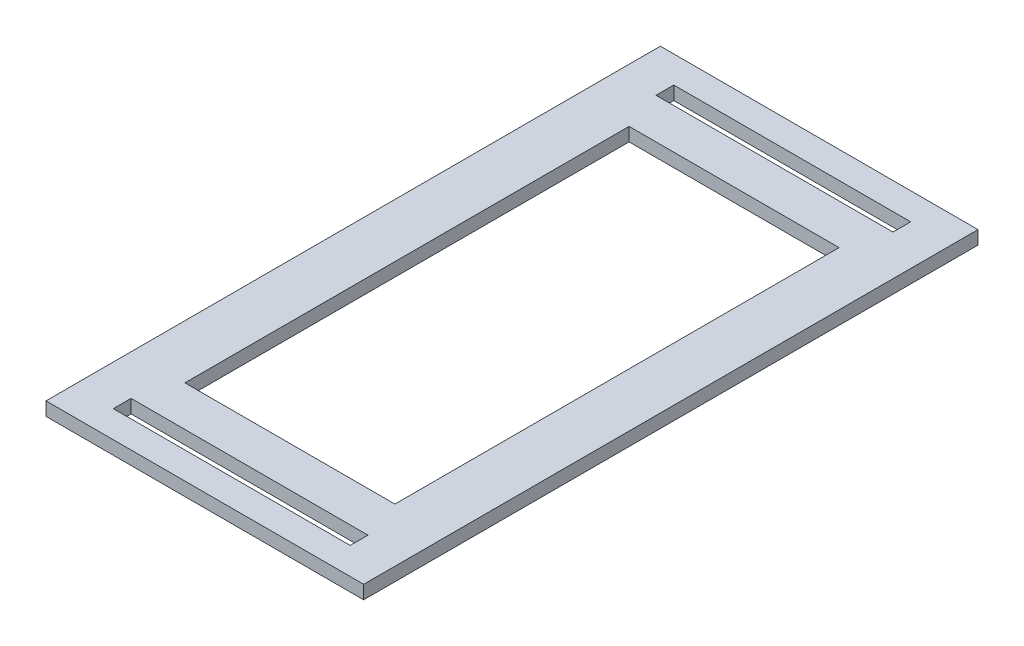
ISO-10303-21;
HEADER;
FILE_DESCRIPTION(('STEP AP214'),'2;1');
FILE_NAME('part.step','',(''),(''),'','','');
FILE_SCHEMA(('AUTOMOTIVE_DESIGN { 1 0 10303 214 1 1 1 1 }'));
ENDSEC;
DATA;
#1=APPLICATION_CONTEXT('core data for automotive mechanical design processes');
#2=APPLICATION_PROTOCOL_DEFINITION('international standard','automotive_design',2000,#1);
#3=PRODUCT_CONTEXT('',#1,'mechanical');
#4=PRODUCT('Part','Part','',(#3));
#5=PRODUCT_RELATED_PRODUCT_CATEGORY('part','',(#4));
#6=PRODUCT_DEFINITION_FORMATION('','',#4);
#7=PRODUCT_DEFINITION_CONTEXT('part definition',#1,'design');
#8=PRODUCT_DEFINITION('design','',#6,#7);
#9=PRODUCT_DEFINITION_SHAPE('','',#8);
#10=(LENGTH_UNIT() NAMED_UNIT(*) SI_UNIT(.MILLI.,.METRE.));
#11=(NAMED_UNIT(*) PLANE_ANGLE_UNIT() SI_UNIT($,.RADIAN.));
#12=(NAMED_UNIT(*) SI_UNIT($,.STERADIAN.) SOLID_ANGLE_UNIT());
#13=UNCERTAINTY_MEASURE_WITH_UNIT(LENGTH_MEASURE(1.E-05),#10,'distance_accuracy_value','');
#14=(GEOMETRIC_REPRESENTATION_CONTEXT(3) GLOBAL_UNCERTAINTY_ASSIGNED_CONTEXT((#13)) GLOBAL_UNIT_ASSIGNED_CONTEXT((#10,
#11,#12)) REPRESENTATION_CONTEXT('',''));
#15=CARTESIAN_POINT('',(0.,0.,0.));
#16=DIRECTION('',(0.,0.,1.));
#17=DIRECTION('',(1.,0.,0.));
#18=AXIS2_PLACEMENT_3D('',#15,#16,#17);
#19=CARTESIAN_POINT('',(0.,3.175,0.));
#20=DIRECTION('',(0.,1.,0.));
#21=DIRECTION('',(0.,0.,1.));
#22=AXIS2_PLACEMENT_3D('',#19,#20,#21);
#23=PLANE('',#22);
#24=DIRECTION('',(0.,0.,1.));
#25=VECTOR('',#24,1.);
#26=CARTESIAN_POINT('',(-37.465,3.175,-72.4535));
#27=LINE('',#26,#25);
#28=CARTESIAN_POINT('',(-37.465,3.175,-72.4535));
#29=VERTEX_POINT('',#28);
#30=CARTESIAN_POINT('',(-37.465,3.175,72.4535));
#31=VERTEX_POINT('',#30);
#32=EDGE_CURVE('E246',#29,#31,#27,.T.);
#33=ORIENTED_EDGE('',*,*,#32,.T.);
#34=DIRECTION('',(1.,0.,0.));
#35=VECTOR('',#34,1.);
#36=CARTESIAN_POINT('',(-37.465,3.175,72.4535));
#37=LINE('',#36,#35);
#38=CARTESIAN_POINT('',(37.465,3.175,72.4535));
#39=VERTEX_POINT('',#38);
#40=EDGE_CURVE('E249',#31,#39,#37,.T.);
#41=ORIENTED_EDGE('',*,*,#40,.T.);
#42=DIRECTION('',(0.,0.,-1.));
#43=VECTOR('',#42,1.);
#44=CARTESIAN_POINT('',(37.465,3.175,-72.4535));
#45=LINE('',#44,#43);
#46=CARTESIAN_POINT('',(37.465,3.175,-72.4535));
#47=VERTEX_POINT('',#46);
#48=EDGE_CURVE('E252',#39,#47,#45,.T.);
#49=ORIENTED_EDGE('',*,*,#48,.T.);
#50=DIRECTION('',(-1.,0.,0.));
#51=VECTOR('',#50,1.);
#52=CARTESIAN_POINT('',(-37.465,3.175,-72.4535));
#53=LINE('',#52,#51);
#54=EDGE_CURVE('E254',#47,#29,#53,.T.);
#55=ORIENTED_EDGE('',*,*,#54,.T.);
#56=EDGE_LOOP('',(#33,#41,#49,#55));
#57=FACE_BOUND('',#56,.T.);
#58=DIRECTION('',(1.,0.,0.));
#59=VECTOR('',#58,1.);
#60=CARTESIAN_POINT('',(-27.94,3.175,66.1035));
#61=LINE('',#60,#59);
#62=CARTESIAN_POINT('',(-27.94,3.175,66.1035));
#63=VERTEX_POINT('',#62);
#64=CARTESIAN_POINT('',(27.94,3.175,66.1035));
#65=VERTEX_POINT('',#64);
#66=EDGE_CURVE('E217',#63,#65,#61,.T.);
#67=ORIENTED_EDGE('',*,*,#66,.F.);
#68=DIRECTION('',(0.,0.,1.));
#69=VECTOR('',#68,1.);
#70=CARTESIAN_POINT('',(-27.94,3.175,61.9125));
#71=LINE('',#70,#69);
#72=CARTESIAN_POINT('',(-27.94,3.175,61.9125));
#73=VERTEX_POINT('',#72);
#74=EDGE_CURVE('E215',#73,#63,#71,.T.);
#75=ORIENTED_EDGE('',*,*,#74,.F.);
#76=DIRECTION('',(-1.,0.,0.));
#77=VECTOR('',#76,1.);
#78=CARTESIAN_POINT('',(-27.94,3.175,61.9125));
#79=LINE('',#78,#77);
#80=CARTESIAN_POINT('',(27.94,3.175,61.9125));
#81=VERTEX_POINT('',#80);
#82=EDGE_CURVE('E223',#81,#73,#79,.T.);
#83=ORIENTED_EDGE('',*,*,#82,.F.);
#84=DIRECTION('',(0.,0.,-1.));
#85=VECTOR('',#84,1.);
#86=CARTESIAN_POINT('',(27.94,3.175,61.9125));
#87=LINE('',#86,#85);
#88=EDGE_CURVE('E220',#65,#81,#87,.T.);
#89=ORIENTED_EDGE('',*,*,#88,.F.);
#90=EDGE_LOOP('',(#67,#75,#83,#89));
#91=FACE_BOUND('',#90,.T.);
#92=DIRECTION('',(1.,0.,0.));
#93=VECTOR('',#92,1.);
#94=CARTESIAN_POINT('',(-27.94,3.175,-61.9125));
#95=LINE('',#94,#93);
#96=CARTESIAN_POINT('',(-27.94,3.175,-61.9125));
#97=VERTEX_POINT('',#96);
#98=CARTESIAN_POINT('',(27.94,3.175,-61.9125));
#99=VERTEX_POINT('',#98);
#100=EDGE_CURVE('E186',#97,#99,#95,.T.);
#101=ORIENTED_EDGE('',*,*,#100,.F.);
#102=DIRECTION('',(0.,0.,1.));
#103=VECTOR('',#102,1.);
#104=CARTESIAN_POINT('',(-27.94,3.175,-66.1035));
#105=LINE('',#104,#103);
#106=CARTESIAN_POINT('',(-27.94,3.175,-66.1035));
#107=VERTEX_POINT('',#106);
#108=EDGE_CURVE('E184',#107,#97,#105,.T.);
#109=ORIENTED_EDGE('',*,*,#108,.F.);
#110=DIRECTION('',(-1.,0.,0.));
#111=VECTOR('',#110,1.);
#112=CARTESIAN_POINT('',(-27.94,3.175,-66.1035));
#113=LINE('',#112,#111);
#114=CARTESIAN_POINT('',(27.94,3.175,-66.1035));
#115=VERTEX_POINT('',#114);
#116=EDGE_CURVE('E192',#115,#107,#113,.T.);
#117=ORIENTED_EDGE('',*,*,#116,.F.);
#118=DIRECTION('',(0.,0.,-1.));
#119=VECTOR('',#118,1.);
#120=CARTESIAN_POINT('',(27.94,3.175,-66.1035));
#121=LINE('',#120,#119);
#122=EDGE_CURVE('E189',#99,#115,#121,.T.);
#123=ORIENTED_EDGE('',*,*,#122,.F.);
#124=EDGE_LOOP('',(#101,#109,#117,#123));
#125=FACE_BOUND('',#124,.T.);
#126=DIRECTION('',(1.,0.,0.));
#127=VECTOR('',#126,1.);
#128=CARTESIAN_POINT('',(-24.765,3.175,52.3875));
#129=LINE('',#128,#127);
#130=CARTESIAN_POINT('',(-24.765,3.175,52.3875));
#131=VERTEX_POINT('',#130);
#132=CARTESIAN_POINT('',(24.765,3.175,52.3875));
#133=VERTEX_POINT('',#132);
#134=EDGE_CURVE('E156',#131,#133,#129,.T.);
#135=ORIENTED_EDGE('',*,*,#134,.F.);
#136=DIRECTION('',(0.,0.,1.));
#137=VECTOR('',#136,1.);
#138=CARTESIAN_POINT('',(-24.765,3.175,-52.3875));
#139=LINE('',#138,#137);
#140=CARTESIAN_POINT('',(-24.765,3.175,-52.3875));
#141=VERTEX_POINT('',#140);
#142=EDGE_CURVE('E148',#141,#131,#139,.T.);
#143=ORIENTED_EDGE('',*,*,#142,.F.);
#144=DIRECTION('',(-1.,0.,0.));
#145=VECTOR('',#144,1.);
#146=CARTESIAN_POINT('',(-24.765,3.175,-52.3875));
#147=LINE('',#146,#145);
#148=CARTESIAN_POINT('',(24.765,3.175,-52.3875));
#149=VERTEX_POINT('',#148);
#150=EDGE_CURVE('E170',#149,#141,#147,.T.);
#151=ORIENTED_EDGE('',*,*,#150,.F.);
#152=DIRECTION('',(0.,0.,-1.));
#153=VECTOR('',#152,1.);
#154=CARTESIAN_POINT('',(24.765,3.175,-52.3875));
#155=LINE('',#154,#153);
#156=EDGE_CURVE('E168',#133,#149,#155,.T.);
#157=ORIENTED_EDGE('',*,*,#156,.F.);
#158=EDGE_LOOP('',(#135,#143,#151,#157));
#159=FACE_BOUND('',#158,.T.);
#160=ADVANCED_FACE('F35',(#57,#91,#125,#159),#23,.T.);
#161=CARTESIAN_POINT('',(0.,0.,0.));
#162=DIRECTION('',(0.,1.,0.));
#163=DIRECTION('',(0.,0.,1.));
#164=AXIS2_PLACEMENT_3D('',#161,#162,#163);
#165=PLANE('',#164);
#166=DIRECTION('',(0.,0.,1.));
#167=VECTOR('',#166,1.);
#168=CARTESIAN_POINT('',(-27.94,0.,-66.1035));
#169=LINE('',#168,#167);
#170=CARTESIAN_POINT('',(-27.94,0.,-66.1035));
#171=VERTEX_POINT('',#170);
#172=CARTESIAN_POINT('',(-27.94,0.,-61.9125));
#173=VERTEX_POINT('',#172);
#174=EDGE_CURVE('E164',#171,#173,#169,.T.);
#175=ORIENTED_EDGE('',*,*,#174,.T.);
#176=DIRECTION('',(1.,0.,0.));
#177=VECTOR('',#176,1.);
#178=CARTESIAN_POINT('',(-27.94,0.,-61.9125));
#179=LINE('',#178,#177);
#180=CARTESIAN_POINT('',(27.94,0.,-61.9125));
#181=VERTEX_POINT('',#180);
#182=EDGE_CURVE('E197',#173,#181,#179,.T.);
#183=ORIENTED_EDGE('',*,*,#182,.T.);
#184=DIRECTION('',(0.,0.,-1.));
#185=VECTOR('',#184,1.);
#186=CARTESIAN_POINT('',(27.94,0.,-66.1035));
#187=LINE('',#186,#185);
#188=CARTESIAN_POINT('',(27.94,0.,-66.1035));
#189=VERTEX_POINT('',#188);
#190=EDGE_CURVE('E200',#181,#189,#187,.T.);
#191=ORIENTED_EDGE('',*,*,#190,.T.);
#192=DIRECTION('',(-1.,0.,0.));
#193=VECTOR('',#192,1.);
#194=CARTESIAN_POINT('',(-27.94,0.,-66.1035));
#195=LINE('',#194,#193);
#196=EDGE_CURVE('E187',#189,#171,#195,.T.);
#197=ORIENTED_EDGE('',*,*,#196,.T.);
#198=EDGE_LOOP('',(#175,#183,#191,#197));
#199=FACE_BOUND('',#198,.T.);
#200=DIRECTION('',(0.,0.,1.));
#201=VECTOR('',#200,1.);
#202=CARTESIAN_POINT('',(-37.465,0.,-72.4535));
#203=LINE('',#202,#201);
#204=CARTESIAN_POINT('',(-37.465,0.,-72.4535));
#205=VERTEX_POINT('',#204);
#206=CARTESIAN_POINT('',(-37.465,0.,72.4535));
#207=VERTEX_POINT('',#206);
#208=EDGE_CURVE('E245',#205,#207,#203,.T.);
#209=ORIENTED_EDGE('',*,*,#208,.F.);
#210=DIRECTION('',(-1.,0.,0.));
#211=VECTOR('',#210,1.);
#212=CARTESIAN_POINT('',(-37.465,0.,-72.4535));
#213=LINE('',#212,#211);
#214=CARTESIAN_POINT('',(37.465,0.,-72.4535));
#215=VERTEX_POINT('',#214);
#216=EDGE_CURVE('E250',#215,#205,#213,.T.);
#217=ORIENTED_EDGE('',*,*,#216,.F.);
#218=DIRECTION('',(0.,0.,-1.));
#219=VECTOR('',#218,1.);
#220=CARTESIAN_POINT('',(37.465,0.,-72.4535));
#221=LINE('',#220,#219);
#222=CARTESIAN_POINT('',(37.465,0.,72.4535));
#223=VERTEX_POINT('',#222);
#224=EDGE_CURVE('E261',#223,#215,#221,.T.);
#225=ORIENTED_EDGE('',*,*,#224,.F.);
#226=DIRECTION('',(1.,0.,0.));
#227=VECTOR('',#226,1.);
#228=CARTESIAN_POINT('',(-37.465,0.,72.4535));
#229=LINE('',#228,#227);
#230=EDGE_CURVE('E259',#207,#223,#229,.T.);
#231=ORIENTED_EDGE('',*,*,#230,.F.);
#232=EDGE_LOOP('',(#209,#217,#225,#231));
#233=FACE_BOUND('',#232,.T.);
#234=DIRECTION('',(0.,0.,1.));
#235=VECTOR('',#234,1.);
#236=CARTESIAN_POINT('',(-27.94,0.,61.9125));
#237=LINE('',#236,#235);
#238=CARTESIAN_POINT('',(-27.94,0.,61.9125));
#239=VERTEX_POINT('',#238);
#240=CARTESIAN_POINT('',(-27.94,0.,66.1035));
#241=VERTEX_POINT('',#240);
#242=EDGE_CURVE('E214',#239,#241,#237,.T.);
#243=ORIENTED_EDGE('',*,*,#242,.T.);
#244=DIRECTION('',(1.,0.,0.));
#245=VECTOR('',#244,1.);
#246=CARTESIAN_POINT('',(-27.94,0.,66.1035));
#247=LINE('',#246,#245);
#248=CARTESIAN_POINT('',(27.94,0.,66.1035));
#249=VERTEX_POINT('',#248);
#250=EDGE_CURVE('E228',#241,#249,#247,.T.);
#251=ORIENTED_EDGE('',*,*,#250,.T.);
#252=DIRECTION('',(0.,0.,-1.));
#253=VECTOR('',#252,1.);
#254=CARTESIAN_POINT('',(27.94,0.,61.9125));
#255=LINE('',#254,#253);
#256=CARTESIAN_POINT('',(27.94,0.,61.9125));
#257=VERTEX_POINT('',#256);
#258=EDGE_CURVE('E231',#249,#257,#255,.T.);
#259=ORIENTED_EDGE('',*,*,#258,.T.);
#260=DIRECTION('',(-1.,0.,0.));
#261=VECTOR('',#260,1.);
#262=CARTESIAN_POINT('',(-27.94,0.,61.9125));
#263=LINE('',#262,#261);
#264=EDGE_CURVE('E218',#257,#239,#263,.T.);
#265=ORIENTED_EDGE('',*,*,#264,.T.);
#266=EDGE_LOOP('',(#243,#251,#259,#265));
#267=FACE_BOUND('',#266,.T.);
#268=DIRECTION('',(0.,0.,1.));
#269=VECTOR('',#268,1.);
#270=CARTESIAN_POINT('',(-24.765,0.,-52.3875));
#271=LINE('',#270,#269);
#272=CARTESIAN_POINT('',(-24.765,0.,-52.3875));
#273=VERTEX_POINT('',#272);
#274=CARTESIAN_POINT('',(-24.765,0.,52.3875));
#275=VERTEX_POINT('',#274);
#276=EDGE_CURVE('E58',#273,#275,#271,.T.);
#277=ORIENTED_EDGE('',*,*,#276,.T.);
#278=DIRECTION('',(1.,0.,0.));
#279=VECTOR('',#278,1.);
#280=CARTESIAN_POINT('',(-24.765,0.,52.3875));
#281=LINE('',#280,#279);
#282=CARTESIAN_POINT('',(24.765,0.,52.3875));
#283=VERTEX_POINT('',#282);
#284=EDGE_CURVE('E163',#275,#283,#281,.T.);
#285=ORIENTED_EDGE('',*,*,#284,.T.);
#286=DIRECTION('',(0.,0.,-1.));
#287=VECTOR('',#286,1.);
#288=CARTESIAN_POINT('',(24.765,0.,-52.3875));
#289=LINE('',#288,#287);
#290=CARTESIAN_POINT('',(24.765,0.,-52.3875));
#291=VERTEX_POINT('',#290);
#292=EDGE_CURVE('E176',#283,#291,#289,.T.);
#293=ORIENTED_EDGE('',*,*,#292,.T.);
#294=DIRECTION('',(-1.,0.,0.));
#295=VECTOR('',#294,1.);
#296=CARTESIAN_POINT('',(-24.765,0.,-52.3875));
#297=LINE('',#296,#295);
#298=EDGE_CURVE('E157',#291,#273,#297,.T.);
#299=ORIENTED_EDGE('',*,*,#298,.T.);
#300=EDGE_LOOP('',(#277,#285,#293,#299));
#301=FACE_BOUND('',#300,.T.);
#302=ADVANCED_FACE('F279',(#199,#233,#267,#301),#165,.F.);
#303=CARTESIAN_POINT('',(-37.465,3.175,-72.4535));
#304=DIRECTION('',(1.,0.,0.));
#305=DIRECTION('',(0.,0.,-1.));
#306=AXIS2_PLACEMENT_3D('',#303,#304,#305);
#307=PLANE('',#306);
#308=ORIENTED_EDGE('',*,*,#208,.T.);
#309=DIRECTION('',(0.,-1.,0.));
#310=VECTOR('',#309,1.);
#311=CARTESIAN_POINT('',(-37.465,3.175,72.4535));
#312=LINE('',#311,#310);
#313=EDGE_CURVE('E11',#31,#207,#312,.T.);
#314=ORIENTED_EDGE('',*,*,#313,.F.);
#315=ORIENTED_EDGE('',*,*,#32,.F.);
#316=DIRECTION('',(0.,-1.,0.));
#317=VECTOR('',#316,1.);
#318=CARTESIAN_POINT('',(-37.465,3.175,-72.4535));
#319=LINE('',#318,#317);
#320=EDGE_CURVE('E256',#29,#205,#319,.T.);
#321=ORIENTED_EDGE('',*,*,#320,.T.);
#322=EDGE_LOOP('',(#308,#314,#315,#321));
#323=FACE_BOUND('',#322,.T.);
#324=ADVANCED_FACE('F37',(#323),#307,.F.);
#325=CARTESIAN_POINT('',(-37.465,3.175,72.4535));
#326=DIRECTION('',(0.,0.,-1.));
#327=DIRECTION('',(-1.,0.,0.));
#328=AXIS2_PLACEMENT_3D('',#325,#326,#327);
#329=PLANE('',#328);
#330=ORIENTED_EDGE('',*,*,#230,.T.);
#331=DIRECTION('',(0.,-1.,0.));
#332=VECTOR('',#331,1.);
#333=CARTESIAN_POINT('',(37.465,3.175,72.4535));
#334=LINE('',#333,#332);
#335=EDGE_CURVE('E43',#39,#223,#334,.T.);
#336=ORIENTED_EDGE('',*,*,#335,.F.);
#337=ORIENTED_EDGE('',*,*,#40,.F.);
#338=ORIENTED_EDGE('',*,*,#313,.T.);
#339=EDGE_LOOP('',(#330,#336,#337,#338));
#340=FACE_BOUND('',#339,.T.);
#341=ADVANCED_FACE('F290',(#340),#329,.F.);
#342=CARTESIAN_POINT('',(37.465,3.175,-72.4535));
#343=DIRECTION('',(-1.,0.,0.));
#344=DIRECTION('',(0.,0.,1.));
#345=AXIS2_PLACEMENT_3D('',#342,#343,#344);
#346=PLANE('',#345);
#347=ORIENTED_EDGE('',*,*,#224,.T.);
#348=DIRECTION('',(0.,-1.,0.));
#349=VECTOR('',#348,1.);
#350=CARTESIAN_POINT('',(37.465,3.175,-72.4535));
#351=LINE('',#350,#349);
#352=EDGE_CURVE('E266',#47,#215,#351,.T.);
#353=ORIENTED_EDGE('',*,*,#352,.F.);
#354=ORIENTED_EDGE('',*,*,#48,.F.);
#355=ORIENTED_EDGE('',*,*,#335,.T.);
#356=EDGE_LOOP('',(#347,#353,#354,#355));
#357=FACE_BOUND('',#356,.T.);
#358=ADVANCED_FACE('F273',(#357),#346,.F.);
#359=CARTESIAN_POINT('',(-37.465,3.175,-72.4535));
#360=DIRECTION('',(0.,0.,1.));
#361=DIRECTION('',(1.,0.,0.));
#362=AXIS2_PLACEMENT_3D('',#359,#360,#361);
#363=PLANE('',#362);
#364=ORIENTED_EDGE('',*,*,#216,.T.);
#365=ORIENTED_EDGE('',*,*,#320,.F.);
#366=ORIENTED_EDGE('',*,*,#54,.F.);
#367=ORIENTED_EDGE('',*,*,#352,.T.);
#368=EDGE_LOOP('',(#364,#365,#366,#367));
#369=FACE_BOUND('',#368,.T.);
#370=ADVANCED_FACE('F283',(#369),#363,.F.);
#371=CARTESIAN_POINT('',(-27.94,3.175,61.9125));
#372=DIRECTION('',(1.,0.,0.));
#373=DIRECTION('',(0.,0.,-1.));
#374=AXIS2_PLACEMENT_3D('',#371,#372,#373);
#375=PLANE('',#374);
#376=ORIENTED_EDGE('',*,*,#242,.F.);
#377=DIRECTION('',(0.,-1.,0.));
#378=VECTOR('',#377,1.);
#379=CARTESIAN_POINT('',(-27.94,3.175,61.9125));
#380=LINE('',#379,#378);
#381=EDGE_CURVE('E225',#73,#239,#380,.T.);
#382=ORIENTED_EDGE('',*,*,#381,.F.);
#383=ORIENTED_EDGE('',*,*,#74,.T.);
#384=DIRECTION('',(0.,-1.,0.));
#385=VECTOR('',#384,1.);
#386=CARTESIAN_POINT('',(-27.94,3.175,66.1035));
#387=LINE('',#386,#385);
#388=EDGE_CURVE('E242',#63,#241,#387,.T.);
#389=ORIENTED_EDGE('',*,*,#388,.T.);
#390=EDGE_LOOP('',(#376,#382,#383,#389));
#391=FACE_BOUND('',#390,.T.);
#392=ADVANCED_FACE('F305',(#391),#375,.T.);
#393=CARTESIAN_POINT('',(-27.94,3.175,66.1035));
#394=DIRECTION('',(0.,0.,-1.));
#395=DIRECTION('',(-1.,0.,0.));
#396=AXIS2_PLACEMENT_3D('',#393,#394,#395);
#397=PLANE('',#396);
#398=ORIENTED_EDGE('',*,*,#250,.F.);
#399=ORIENTED_EDGE('',*,*,#388,.F.);
#400=ORIENTED_EDGE('',*,*,#66,.T.);
#401=DIRECTION('',(0.,-1.,0.));
#402=VECTOR('',#401,1.);
#403=CARTESIAN_POINT('',(27.94,3.175,66.1035));
#404=LINE('',#403,#402);
#405=EDGE_CURVE('E240',#65,#249,#404,.T.);
#406=ORIENTED_EDGE('',*,*,#405,.T.);
#407=EDGE_LOOP('',(#398,#399,#400,#406));
#408=FACE_BOUND('',#407,.T.);
#409=ADVANCED_FACE('F312',(#408),#397,.T.);
#410=CARTESIAN_POINT('',(27.94,3.175,61.9125));
#411=DIRECTION('',(-1.,0.,0.));
#412=DIRECTION('',(0.,0.,1.));
#413=AXIS2_PLACEMENT_3D('',#410,#411,#412);
#414=PLANE('',#413);
#415=ORIENTED_EDGE('',*,*,#258,.F.);
#416=ORIENTED_EDGE('',*,*,#405,.F.);
#417=ORIENTED_EDGE('',*,*,#88,.T.);
#418=DIRECTION('',(0.,-1.,0.));
#419=VECTOR('',#418,1.);
#420=CARTESIAN_POINT('',(27.94,3.175,61.9125));
#421=LINE('',#420,#419);
#422=EDGE_CURVE('E238',#81,#257,#421,.T.);
#423=ORIENTED_EDGE('',*,*,#422,.T.);
#424=EDGE_LOOP('',(#415,#416,#417,#423));
#425=FACE_BOUND('',#424,.T.);
#426=ADVANCED_FACE('F317',(#425),#414,.T.);
#427=CARTESIAN_POINT('',(-27.94,3.175,61.9125));
#428=DIRECTION('',(0.,0.,1.));
#429=DIRECTION('',(1.,0.,0.));
#430=AXIS2_PLACEMENT_3D('',#427,#428,#429);
#431=PLANE('',#430);
#432=ORIENTED_EDGE('',*,*,#264,.F.);
#433=ORIENTED_EDGE('',*,*,#422,.F.);
#434=ORIENTED_EDGE('',*,*,#82,.T.);
#435=ORIENTED_EDGE('',*,*,#381,.T.);
#436=EDGE_LOOP('',(#432,#433,#434,#435));
#437=FACE_BOUND('',#436,.T.);
#438=ADVANCED_FACE('F324',(#437),#431,.T.);
#439=CARTESIAN_POINT('',(-27.94,3.175,-66.1035));
#440=DIRECTION('',(1.,0.,0.));
#441=DIRECTION('',(0.,0.,-1.));
#442=AXIS2_PLACEMENT_3D('',#439,#440,#441);
#443=PLANE('',#442);
#444=ORIENTED_EDGE('',*,*,#174,.F.);
#445=DIRECTION('',(0.,-1.,0.));
#446=VECTOR('',#445,1.);
#447=CARTESIAN_POINT('',(-27.94,3.175,-66.1035));
#448=LINE('',#447,#446);
#449=EDGE_CURVE('E194',#107,#171,#448,.T.);
#450=ORIENTED_EDGE('',*,*,#449,.F.);
#451=ORIENTED_EDGE('',*,*,#108,.T.);
#452=DIRECTION('',(0.,-1.,0.));
#453=VECTOR('',#452,1.);
#454=CARTESIAN_POINT('',(-27.94,3.175,-61.9125));
#455=LINE('',#454,#453);
#456=EDGE_CURVE('E211',#97,#173,#455,.T.);
#457=ORIENTED_EDGE('',*,*,#456,.T.);
#458=EDGE_LOOP('',(#444,#450,#451,#457));
#459=FACE_BOUND('',#458,.T.);
#460=ADVANCED_FACE('F346',(#459),#443,.T.);
#461=CARTESIAN_POINT('',(-27.94,3.175,-61.9125));
#462=DIRECTION('',(0.,0.,-1.));
#463=DIRECTION('',(-1.,0.,0.));
#464=AXIS2_PLACEMENT_3D('',#461,#462,#463);
#465=PLANE('',#464);
#466=ORIENTED_EDGE('',*,*,#182,.F.);
#467=ORIENTED_EDGE('',*,*,#456,.F.);
#468=ORIENTED_EDGE('',*,*,#100,.T.);
#469=DIRECTION('',(0.,-1.,0.));
#470=VECTOR('',#469,1.);
#471=CARTESIAN_POINT('',(27.94,3.175,-61.9125));
#472=LINE('',#471,#470);
#473=EDGE_CURVE('E209',#99,#181,#472,.T.);
#474=ORIENTED_EDGE('',*,*,#473,.T.);
#475=EDGE_LOOP('',(#466,#467,#468,#474));
#476=FACE_BOUND('',#475,.T.);
#477=ADVANCED_FACE('F340',(#476),#465,.T.);
#478=CARTESIAN_POINT('',(27.94,3.175,-66.1035));
#479=DIRECTION('',(-1.,0.,0.));
#480=DIRECTION('',(0.,0.,1.));
#481=AXIS2_PLACEMENT_3D('',#478,#479,#480);
#482=PLANE('',#481);
#483=ORIENTED_EDGE('',*,*,#190,.F.);
#484=ORIENTED_EDGE('',*,*,#473,.F.);
#485=ORIENTED_EDGE('',*,*,#122,.T.);
#486=DIRECTION('',(0.,-1.,0.));
#487=VECTOR('',#486,1.);
#488=CARTESIAN_POINT('',(27.94,3.175,-66.1035));
#489=LINE('',#488,#487);
#490=EDGE_CURVE('E207',#115,#189,#489,.T.);
#491=ORIENTED_EDGE('',*,*,#490,.T.);
#492=EDGE_LOOP('',(#483,#484,#485,#491));
#493=FACE_BOUND('',#492,.T.);
#494=ADVANCED_FACE('F343',(#493),#482,.T.);
#495=CARTESIAN_POINT('',(-27.94,3.175,-66.1035));
#496=DIRECTION('',(0.,0.,1.));
#497=DIRECTION('',(1.,0.,0.));
#498=AXIS2_PLACEMENT_3D('',#495,#496,#497);
#499=PLANE('',#498);
#500=ORIENTED_EDGE('',*,*,#196,.F.);
#501=ORIENTED_EDGE('',*,*,#490,.F.);
#502=ORIENTED_EDGE('',*,*,#116,.T.);
#503=ORIENTED_EDGE('',*,*,#449,.T.);
#504=EDGE_LOOP('',(#500,#501,#502,#503));
#505=FACE_BOUND('',#504,.T.);
#506=ADVANCED_FACE('F349',(#505),#499,.T.);
#507=CARTESIAN_POINT('',(-24.765,3.175,-52.3875));
#508=DIRECTION('',(1.,0.,0.));
#509=DIRECTION('',(0.,0.,-1.));
#510=AXIS2_PLACEMENT_3D('',#507,#508,#509);
#511=PLANE('',#510);
#512=ORIENTED_EDGE('',*,*,#276,.F.);
#513=DIRECTION('',(0.,-1.,0.));
#514=VECTOR('',#513,1.);
#515=CARTESIAN_POINT('',(-24.765,3.175,-52.3875));
#516=LINE('',#515,#514);
#517=EDGE_CURVE('E152',#141,#273,#516,.T.);
#518=ORIENTED_EDGE('',*,*,#517,.F.);
#519=ORIENTED_EDGE('',*,*,#142,.T.);
#520=DIRECTION('',(0.,-1.,0.));
#521=VECTOR('',#520,1.);
#522=CARTESIAN_POINT('',(-24.765,3.175,52.3875));
#523=LINE('',#522,#521);
#524=EDGE_CURVE('E151',#131,#275,#523,.T.);
#525=ORIENTED_EDGE('',*,*,#524,.T.);
#526=EDGE_LOOP('',(#512,#518,#519,#525));
#527=FACE_BOUND('',#526,.T.);
#528=ADVANCED_FACE('F150',(#527),#511,.T.);
#529=CARTESIAN_POINT('',(-24.765,3.175,52.3875));
#530=DIRECTION('',(0.,0.,-1.));
#531=DIRECTION('',(-1.,0.,0.));
#532=AXIS2_PLACEMENT_3D('',#529,#530,#531);
#533=PLANE('',#532);
#534=ORIENTED_EDGE('',*,*,#284,.F.);
#535=ORIENTED_EDGE('',*,*,#524,.F.);
#536=ORIENTED_EDGE('',*,*,#134,.T.);
#537=DIRECTION('',(0.,-1.,0.));
#538=VECTOR('',#537,1.);
#539=CARTESIAN_POINT('',(24.765,3.175,52.3875));
#540=LINE('',#539,#538);
#541=EDGE_CURVE('E165',#133,#283,#540,.T.);
#542=ORIENTED_EDGE('',*,*,#541,.T.);
#543=EDGE_LOOP('',(#534,#535,#536,#542));
#544=FACE_BOUND('',#543,.T.);
#545=ADVANCED_FACE('F160',(#544),#533,.T.);
#546=CARTESIAN_POINT('',(24.765,3.175,-52.3875));
#547=DIRECTION('',(-1.,0.,0.));
#548=DIRECTION('',(0.,0.,1.));
#549=AXIS2_PLACEMENT_3D('',#546,#547,#548);
#550=PLANE('',#549);
#551=ORIENTED_EDGE('',*,*,#292,.F.);
#552=ORIENTED_EDGE('',*,*,#541,.F.);
#553=ORIENTED_EDGE('',*,*,#156,.T.);
#554=DIRECTION('',(0.,-1.,0.));
#555=VECTOR('',#554,1.);
#556=CARTESIAN_POINT('',(24.765,3.175,-52.3875));
#557=LINE('',#556,#555);
#558=EDGE_CURVE('E50',#149,#291,#557,.T.);
#559=ORIENTED_EDGE('',*,*,#558,.T.);
#560=EDGE_LOOP('',(#551,#552,#553,#559));
#561=FACE_BOUND('',#560,.T.);
#562=ADVANCED_FACE('F406',(#561),#550,.T.);
#563=CARTESIAN_POINT('',(-24.765,3.175,-52.3875));
#564=DIRECTION('',(0.,0.,1.));
#565=DIRECTION('',(1.,0.,0.));
#566=AXIS2_PLACEMENT_3D('',#563,#564,#565);
#567=PLANE('',#566);
#568=ORIENTED_EDGE('',*,*,#298,.F.);
#569=ORIENTED_EDGE('',*,*,#558,.F.);
#570=ORIENTED_EDGE('',*,*,#150,.T.);
#571=ORIENTED_EDGE('',*,*,#517,.T.);
#572=EDGE_LOOP('',(#568,#569,#570,#571));
#573=FACE_BOUND('',#572,.T.);
#574=ADVANCED_FACE('F414',(#573),#567,.T.);
#575=CLOSED_SHELL('',(#160,#302,#324,#341,#358,#370,#392,#409,#426,#438,#460,#477,#494,#506,
#528,#545,#562,#574));
#576=MANIFOLD_SOLID_BREP('B2',#575);
#577=ADVANCED_BREP_SHAPE_REPRESENTATION('',(#18,#576),#14);
#578=SHAPE_DEFINITION_REPRESENTATION(#9,#577);
ENDSEC;
END-ISO-10303-21;
